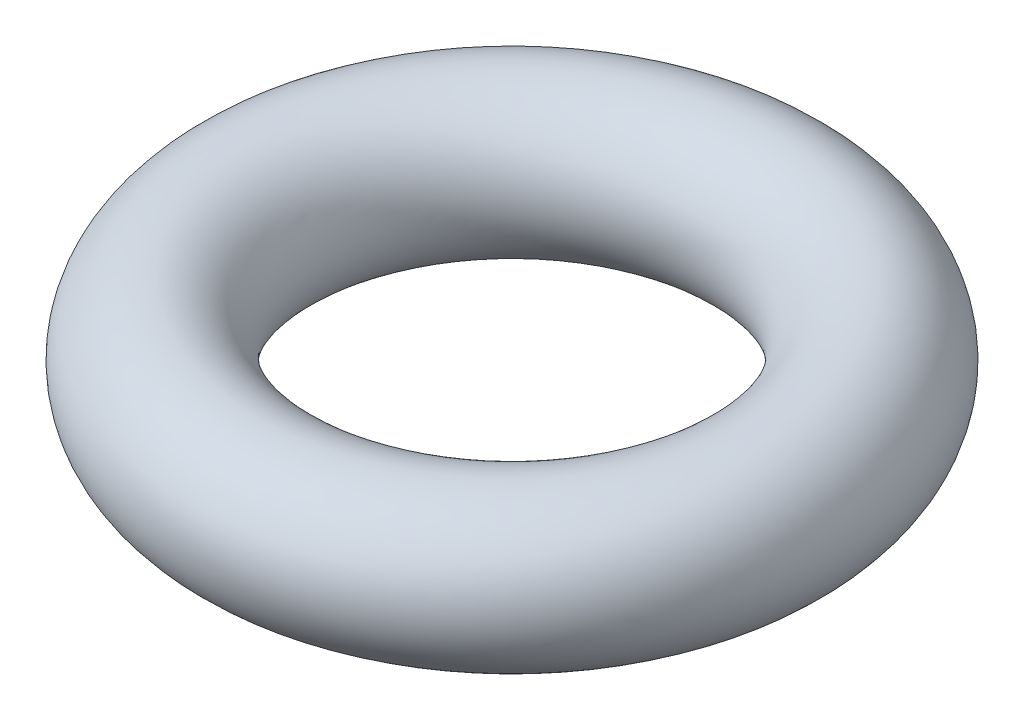
ISO-10303-21;
HEADER;
FILE_DESCRIPTION(('STEP AP214'),'2;1');
FILE_NAME('part.step','',(''),(''),'','','');
FILE_SCHEMA(('AUTOMOTIVE_DESIGN { 1 0 10303 214 1 1 1 1 }'));
ENDSEC;
DATA;
#1=APPLICATION_CONTEXT('core data for automotive mechanical design processes');
#2=APPLICATION_PROTOCOL_DEFINITION('international standard','automotive_design',2000,#1);
#3=PRODUCT_CONTEXT('',#1,'mechanical');
#4=PRODUCT('Part','Part','',(#3));
#5=PRODUCT_RELATED_PRODUCT_CATEGORY('part','',(#4));
#6=PRODUCT_DEFINITION_FORMATION('','',#4);
#7=PRODUCT_DEFINITION_CONTEXT('part definition',#1,'design');
#8=PRODUCT_DEFINITION('design','',#6,#7);
#9=PRODUCT_DEFINITION_SHAPE('','',#8);
#10=(LENGTH_UNIT() NAMED_UNIT(*) SI_UNIT(.MILLI.,.METRE.));
#11=(NAMED_UNIT(*) PLANE_ANGLE_UNIT() SI_UNIT($,.RADIAN.));
#12=(NAMED_UNIT(*) SI_UNIT($,.STERADIAN.) SOLID_ANGLE_UNIT());
#13=UNCERTAINTY_MEASURE_WITH_UNIT(LENGTH_MEASURE(1.E-05),#10,'distance_accuracy_value','');
#14=(GEOMETRIC_REPRESENTATION_CONTEXT(3) GLOBAL_UNCERTAINTY_ASSIGNED_CONTEXT((#13)) GLOBAL_UNIT_ASSIGNED_CONTEXT((#10,
#11,#12)) REPRESENTATION_CONTEXT('',''));
#15=CARTESIAN_POINT('',(0.,0.,0.));
#16=DIRECTION('',(0.,0.,1.));
#17=DIRECTION('',(1.,0.,0.));
#18=AXIS2_PLACEMENT_3D('',#15,#16,#17);
#19=CARTESIAN_POINT('',(0.,0.,0.));
#20=DIRECTION('',(0.,-1.,0.));
#21=DIRECTION('',(0.,0.,-1.));
#22=AXIS2_PLACEMENT_3D('',#19,#20,#21);
#23=TOROIDAL_SURFACE('',#22,5.588,1.651);
#24=CARTESIAN_POINT('',(0.,0.,-7.239));
#25=VERTEX_POINT('',#24);
#26=VERTEX_LOOP('',#25);
#27=FACE_BOUND('',#26,.T.);
#28=ADVANCED_FACE('F26',(#27),#23,.T.);
#29=CLOSED_SHELL('',(#28));
#30=MANIFOLD_SOLID_BREP('B2',#29);
#31=ADVANCED_BREP_SHAPE_REPRESENTATION('',(#18,#30),#14);
#32=SHAPE_DEFINITION_REPRESENTATION(#9,#31);
ENDSEC;
END-ISO-10303-21;
